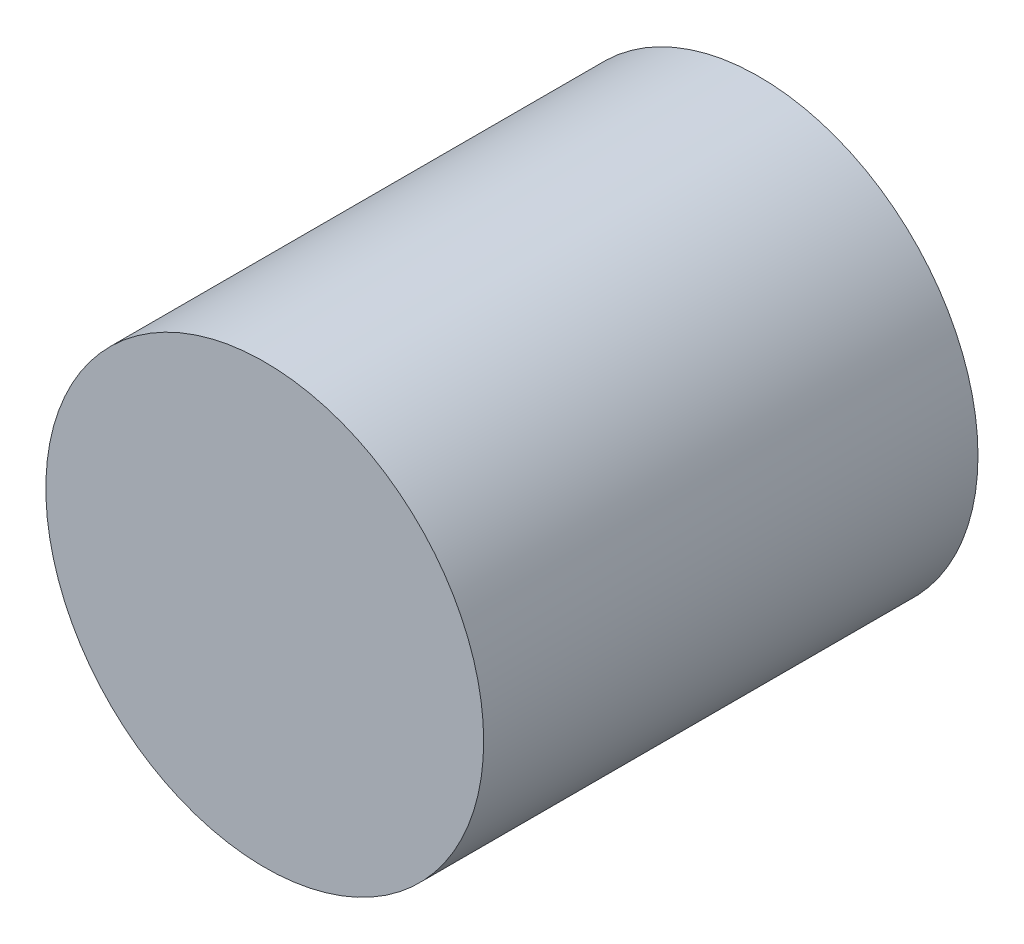
ISO-10303-21;
HEADER;
FILE_DESCRIPTION(('STEP AP214'),'2;1');
FILE_NAME('part.step','',(''),(''),'','','');
FILE_SCHEMA(('AUTOMOTIVE_DESIGN { 1 0 10303 214 1 1 1 1 }'));
ENDSEC;
DATA;
#1=APPLICATION_CONTEXT('core data for automotive mechanical design processes');
#2=APPLICATION_PROTOCOL_DEFINITION('international standard','automotive_design',2000,#1);
#3=PRODUCT_CONTEXT('',#1,'mechanical');
#4=PRODUCT('Part','Part','',(#3));
#5=PRODUCT_RELATED_PRODUCT_CATEGORY('part','',(#4));
#6=PRODUCT_DEFINITION_FORMATION('','',#4);
#7=PRODUCT_DEFINITION_CONTEXT('part definition',#1,'design');
#8=PRODUCT_DEFINITION('design','',#6,#7);
#9=PRODUCT_DEFINITION_SHAPE('','',#8);
#10=(LENGTH_UNIT() NAMED_UNIT(*) SI_UNIT(.MILLI.,.METRE.));
#11=(NAMED_UNIT(*) PLANE_ANGLE_UNIT() SI_UNIT($,.RADIAN.));
#12=(NAMED_UNIT(*) SI_UNIT($,.STERADIAN.) SOLID_ANGLE_UNIT());
#13=UNCERTAINTY_MEASURE_WITH_UNIT(LENGTH_MEASURE(1.E-05),#10,'distance_accuracy_value','');
#14=(GEOMETRIC_REPRESENTATION_CONTEXT(3) GLOBAL_UNCERTAINTY_ASSIGNED_CONTEXT((#13)) GLOBAL_UNIT_ASSIGNED_CONTEXT((#10,
#11,#12)) REPRESENTATION_CONTEXT('',''));
#15=CARTESIAN_POINT('',(0.,0.,0.));
#16=DIRECTION('',(0.,0.,1.));
#17=DIRECTION('',(1.,0.,0.));
#18=AXIS2_PLACEMENT_3D('',#15,#16,#17);
#19=CARTESIAN_POINT('',(0.,0.,3.5));
#20=DIRECTION('',(0.,0.,-1.));
#21=DIRECTION('',(-1.,0.,0.));
#22=AXIS2_PLACEMENT_3D('',#19,#20,#21);
#23=CYLINDRICAL_SURFACE('',#22,1.55);
#24=CARTESIAN_POINT('',(0.,0.,3.5));
#25=DIRECTION('',(0.,0.,1.));
#26=DIRECTION('',(1.,0.,0.));
#27=AXIS2_PLACEMENT_3D('',#24,#25,#26);
#28=CIRCLE('',#27,1.55);
#29=CARTESIAN_POINT('',(1.55,0.,3.5));
#30=VERTEX_POINT('',#29);
#31=EDGE_CURVE('E10',#30,#30,#28,.T.);
#32=ORIENTED_EDGE('',*,*,#31,.F.);
#33=EDGE_LOOP('',(#32));
#34=FACE_BOUND('',#33,.T.);
#35=CARTESIAN_POINT('',(0.,0.,0.));
#36=DIRECTION('',(0.,0.,1.));
#37=DIRECTION('',(1.,0.,0.));
#38=AXIS2_PLACEMENT_3D('',#35,#36,#37);
#39=CIRCLE('',#38,1.55);
#40=CARTESIAN_POINT('',(1.55,0.,0.));
#41=VERTEX_POINT('',#40);
#42=EDGE_CURVE('E34',#41,#41,#39,.T.);
#43=ORIENTED_EDGE('',*,*,#42,.T.);
#44=EDGE_LOOP('',(#43));
#45=FACE_BOUND('',#44,.T.);
#46=ADVANCED_FACE('F31',(#34,#45),#23,.T.);
#47=CARTESIAN_POINT('',(0.,0.,3.5));
#48=DIRECTION('',(0.,0.,1.));
#49=DIRECTION('',(1.,0.,0.));
#50=AXIS2_PLACEMENT_3D('',#47,#48,#49);
#51=PLANE('',#50);
#52=ORIENTED_EDGE('',*,*,#31,.T.);
#53=EDGE_LOOP('',(#52));
#54=FACE_BOUND('',#53,.T.);
#55=ADVANCED_FACE('F46',(#54),#51,.T.);
#56=CARTESIAN_POINT('',(0.,0.,0.));
#57=DIRECTION('',(0.,0.,1.));
#58=DIRECTION('',(1.,0.,0.));
#59=AXIS2_PLACEMENT_3D('',#56,#57,#58);
#60=PLANE('',#59);
#61=ORIENTED_EDGE('',*,*,#42,.F.);
#62=EDGE_LOOP('',(#61));
#63=FACE_BOUND('',#62,.T.);
#64=ADVANCED_FACE('F44',(#63),#60,.F.);
#65=CLOSED_SHELL('',(#46,#55,#64));
#66=MANIFOLD_SOLID_BREP('B2',#65);
#67=ADVANCED_BREP_SHAPE_REPRESENTATION('',(#18,#66),#14);
#68=SHAPE_DEFINITION_REPRESENTATION(#9,#67);
ENDSEC;
END-ISO-10303-21;
